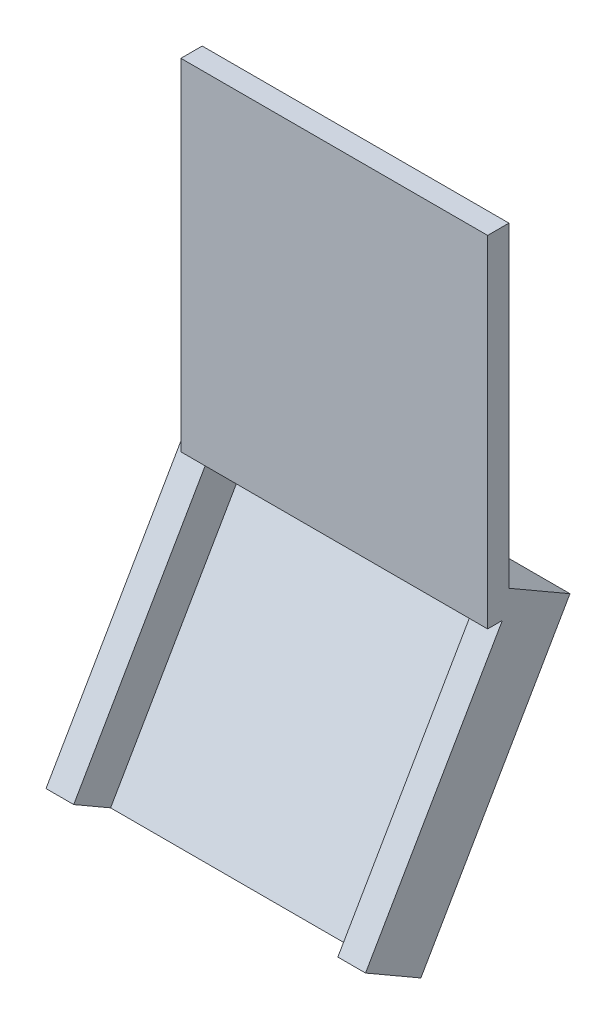
ISO-10303-21;
HEADER;
FILE_DESCRIPTION(('STEP AP214'),'2;1');
FILE_NAME('part.step','',(''),(''),'','','');
FILE_SCHEMA(('AUTOMOTIVE_DESIGN { 1 0 10303 214 1 1 1 1 }'));
ENDSEC;
DATA;
#1=APPLICATION_CONTEXT('core data for automotive mechanical design processes');
#2=APPLICATION_PROTOCOL_DEFINITION('international standard','automotive_design',2000,#1);
#3=PRODUCT_CONTEXT('',#1,'mechanical');
#4=PRODUCT('Part','Part','',(#3));
#5=PRODUCT_RELATED_PRODUCT_CATEGORY('part','',(#4));
#6=PRODUCT_DEFINITION_FORMATION('','',#4);
#7=PRODUCT_DEFINITION_CONTEXT('part definition',#1,'design');
#8=PRODUCT_DEFINITION('design','',#6,#7);
#9=PRODUCT_DEFINITION_SHAPE('','',#8);
#10=(LENGTH_UNIT() NAMED_UNIT(*) SI_UNIT(.MILLI.,.METRE.));
#11=(NAMED_UNIT(*) PLANE_ANGLE_UNIT() SI_UNIT($,.RADIAN.));
#12=(NAMED_UNIT(*) SI_UNIT($,.STERADIAN.) SOLID_ANGLE_UNIT());
#13=UNCERTAINTY_MEASURE_WITH_UNIT(LENGTH_MEASURE(1.E-05),#10,'distance_accuracy_value','');
#14=(GEOMETRIC_REPRESENTATION_CONTEXT(3) GLOBAL_UNCERTAINTY_ASSIGNED_CONTEXT((#13)) GLOBAL_UNIT_ASSIGNED_CONTEXT((#10,
#11,#12)) REPRESENTATION_CONTEXT('',''));
#15=CARTESIAN_POINT('',(0.,0.,0.));
#16=DIRECTION('',(0.,0.,1.));
#17=DIRECTION('',(1.,0.,0.));
#18=AXIS2_PLACEMENT_3D('',#15,#16,#17);
#19=CARTESIAN_POINT('',(0.,0.,1.));
#20=DIRECTION('',(0.,1.,0.));
#21=DIRECTION('',(0.,0.,1.));
#22=AXIS2_PLACEMENT_3D('',#19,#20,#21);
#23=PLANE('',#22);
#24=DIRECTION('',(0.,0.,1.));
#25=VECTOR('',#24,1.);
#26=CARTESIAN_POINT('',(0.7,0.,1.));
#27=LINE('',#26,#25);
#28=CARTESIAN_POINT('',(0.7,0.,0.));
#29=VERTEX_POINT('',#28);
#30=CARTESIAN_POINT('',(0.700000000000002,0.,0.309401076758493));
#31=VERTEX_POINT('',#30);
#32=EDGE_CURVE('E191',#29,#31,#27,.T.);
#33=ORIENTED_EDGE('',*,*,#32,.F.);
#34=DIRECTION('',(1.,0.,0.));
#35=VECTOR('',#34,1.);
#36=CARTESIAN_POINT('',(0.,0.,0.));
#37=LINE('',#36,#35);
#38=CARTESIAN_POINT('',(13.1,0.,0.));
#39=VERTEX_POINT('',#38);
#40=EDGE_CURVE('E253',#29,#39,#37,.T.);
#41=ORIENTED_EDGE('',*,*,#40,.T.);
#42=DIRECTION('',(0.,0.,-1.));
#43=VECTOR('',#42,1.);
#44=CARTESIAN_POINT('',(13.1,0.,0.999999999999999));
#45=LINE('',#44,#43);
#46=CARTESIAN_POINT('',(13.1,0.,0.309401076758494));
#47=VERTEX_POINT('',#46);
#48=EDGE_CURVE('E208',#47,#39,#45,.T.);
#49=ORIENTED_EDGE('',*,*,#48,.F.);
#50=DIRECTION('',(-1.,0.,0.));
#51=VECTOR('',#50,1.);
#52=CARTESIAN_POINT('',(0.,0.,0.309401076758493));
#53=LINE('',#52,#51);
#54=CARTESIAN_POINT('',(14.4,0.,0.309401076758494));
#55=VERTEX_POINT('',#54);
#56=EDGE_CURVE('E211',#55,#47,#53,.T.);
#57=ORIENTED_EDGE('',*,*,#56,.F.);
#58=DIRECTION('',(0.,0.,-1.));
#59=VECTOR('',#58,1.);
#60=CARTESIAN_POINT('',(14.4,0.,1.));
#61=LINE('',#60,#59);
#62=CARTESIAN_POINT('',(14.4,0.,1.));
#63=VERTEX_POINT('',#62);
#64=EDGE_CURVE('E263',#63,#55,#61,.T.);
#65=ORIENTED_EDGE('',*,*,#64,.F.);
#66=DIRECTION('',(1.,0.,0.));
#67=VECTOR('',#66,1.);
#68=CARTESIAN_POINT('',(0.,0.,1.));
#69=LINE('',#68,#67);
#70=CARTESIAN_POINT('',(0.,0.,1.));
#71=VERTEX_POINT('',#70);
#72=EDGE_CURVE('E242',#71,#63,#69,.T.);
#73=ORIENTED_EDGE('',*,*,#72,.F.);
#74=DIRECTION('',(0.,0.,-1.));
#75=VECTOR('',#74,1.);
#76=CARTESIAN_POINT('',(0.,0.,1.));
#77=LINE('',#76,#75);
#78=CARTESIAN_POINT('',(0.,0.,0.309401076758493));
#79=VERTEX_POINT('',#78);
#80=EDGE_CURVE('E266',#71,#79,#77,.T.);
#81=ORIENTED_EDGE('',*,*,#80,.T.);
#82=DIRECTION('',(1.,0.,0.));
#83=VECTOR('',#82,1.);
#84=CARTESIAN_POINT('',(0.,0.,0.309401076758493));
#85=LINE('',#84,#83);
#86=EDGE_CURVE('E52',#79,#31,#85,.T.);
#87=ORIENTED_EDGE('',*,*,#86,.T.);
#88=EDGE_LOOP('',(#33,#41,#49,#57,#65,#73,#81,#87));
#89=FACE_BOUND('',#88,.T.);
#90=ADVANCED_FACE('F37',(#89),#23,.F.);
#91=CARTESIAN_POINT('',(-0.6,-0.866025403784432,-1.50000000000001));
#92=DIRECTION('',(0.,0.499999999999995,0.866025403784442));
#93=DIRECTION('',(0.,-0.866025403784442,0.499999999999995));
#94=AXIS2_PLACEMENT_3D('',#91,#92,#93);
#95=PLANE('',#94);
#96=DIRECTION('',(1.,0.,0.));
#97=VECTOR('',#96,1.);
#98=CARTESIAN_POINT('',(-0.6,-0.866025403784432,-1.50000000000001));
#99=LINE('',#98,#97);
#100=CARTESIAN_POINT('',(0.700000000000002,-0.866025403784432,-1.50000000000001));
#101=VERTEX_POINT('',#100);
#102=CARTESIAN_POINT('',(13.1,-0.866025403784433,-1.50000000000001));
#103=VERTEX_POINT('',#102);
#104=EDGE_CURVE('E228',#101,#103,#99,.T.);
#105=ORIENTED_EDGE('',*,*,#104,.F.);
#106=DIRECTION('',(0.,0.866025403784442,-0.499999999999995));
#107=VECTOR('',#106,1.);
#108=CARTESIAN_POINT('',(0.7,-0.866025403784433,-1.50000000000001));
#109=LINE('',#108,#107);
#110=CARTESIAN_POINT('',(0.700000000000002,-12.1243556529822,4.99999999999992));
#111=VERTEX_POINT('',#110);
#112=EDGE_CURVE('E177',#111,#101,#109,.T.);
#113=ORIENTED_EDGE('',*,*,#112,.F.);
#114=DIRECTION('',(1.,0.,0.));
#115=VECTOR('',#114,1.);
#116=CARTESIAN_POINT('',(-0.6,-12.1243556529822,4.99999999999992));
#117=LINE('',#116,#115);
#118=CARTESIAN_POINT('',(13.1,-12.1243556529822,4.99999999999992));
#119=VERTEX_POINT('',#118);
#120=EDGE_CURVE('E225',#111,#119,#117,.T.);
#121=ORIENTED_EDGE('',*,*,#120,.T.);
#122=DIRECTION('',(0.,-0.866025403784442,0.499999999999995));
#123=VECTOR('',#122,1.);
#124=CARTESIAN_POINT('',(13.1,-0.866025403784433,-1.50000000000001));
#125=LINE('',#124,#123);
#126=EDGE_CURVE('E194',#103,#119,#125,.T.);
#127=ORIENTED_EDGE('',*,*,#126,.F.);
#128=EDGE_LOOP('',(#105,#113,#121,#127));
#129=FACE_BOUND('',#128,.T.);
#130=ADVANCED_FACE('F279',(#129),#95,.T.);
#131=CARTESIAN_POINT('',(-0.6,0.,0.));
#132=DIRECTION('',(0.,0.866025403784442,-0.499999999999994));
#133=DIRECTION('',(0.,0.499999999999994,0.866025403784442));
#134=AXIS2_PLACEMENT_3D('',#131,#132,#133);
#135=PLANE('',#134);
#136=DIRECTION('',(0.,-0.499999999999995,-0.866025403784442));
#137=VECTOR('',#136,1.);
#138=CARTESIAN_POINT('',(0.7,0.133974596215557,0.232050807568872));
#139=LINE('',#138,#137);
#140=EDGE_CURVE('E60',#29,#101,#139,.T.);
#141=ORIENTED_EDGE('',*,*,#140,.T.);
#142=ORIENTED_EDGE('',*,*,#104,.T.);
#143=DIRECTION('',(0.,-0.499999999999994,-0.866025403784442));
#144=VECTOR('',#143,1.);
#145=CARTESIAN_POINT('',(13.1,0.,0.));
#146=LINE('',#145,#144);
#147=EDGE_CURVE('E45',#39,#103,#146,.T.);
#148=ORIENTED_EDGE('',*,*,#147,.F.);
#149=ORIENTED_EDGE('',*,*,#40,.F.);
#150=EDGE_LOOP('',(#141,#142,#148,#149));
#151=FACE_BOUND('',#150,.T.);
#152=ADVANCED_FACE('F277',(#151),#135,.F.);
#153=CARTESIAN_POINT('',(0.,0.,1.));
#154=DIRECTION('',(1.,0.,0.));
#155=DIRECTION('',(0.,0.,-1.));
#156=AXIS2_PLACEMENT_3D('',#153,#154,#155);
#157=PLANE('',#156);
#158=DIRECTION('',(0.,-0.499999999999995,-0.866025403784442));
#159=VECTOR('',#158,1.);
#160=CARTESIAN_POINT('',(0.,0.433012701892217,0.750000000000005));
#161=LINE('',#160,#159);
#162=CARTESIAN_POINT('',(0.,0.133974596215557,0.232050807568871));
#163=VERTEX_POINT('',#162);
#164=CARTESIAN_POINT('',(0.,0.,0.));
#165=VERTEX_POINT('',#164);
#166=EDGE_CURVE('E188',#163,#165,#161,.T.);
#167=ORIENTED_EDGE('',*,*,#166,.F.);
#168=DIRECTION('',(0.,-0.866025403784442,0.499999999999995));
#169=VECTOR('',#168,1.);
#170=CARTESIAN_POINT('',(0.,-0.29903810567666,0.482050807568867));
#171=LINE('',#170,#169);
#172=EDGE_CURVE('E11',#163,#79,#171,.T.);
#173=ORIENTED_EDGE('',*,*,#172,.T.);
#174=ORIENTED_EDGE('',*,*,#80,.F.);
#175=DIRECTION('',(0.,-1.,0.));
#176=VECTOR('',#175,1.);
#177=CARTESIAN_POINT('',(0.,0.,1.));
#178=LINE('',#177,#176);
#179=CARTESIAN_POINT('',(0.,16.,1.));
#180=VERTEX_POINT('',#179);
#181=EDGE_CURVE('E239',#180,#71,#178,.T.);
#182=ORIENTED_EDGE('',*,*,#181,.F.);
#183=DIRECTION('',(0.,0.,-1.));
#184=VECTOR('',#183,1.);
#185=CARTESIAN_POINT('',(0.,16.,1.));
#186=LINE('',#185,#184);
#187=CARTESIAN_POINT('',(0.,16.,0.));
#188=VERTEX_POINT('',#187);
#189=EDGE_CURVE('E249',#180,#188,#186,.T.);
#190=ORIENTED_EDGE('',*,*,#189,.T.);
#191=DIRECTION('',(0.,-1.,0.));
#192=VECTOR('',#191,1.);
#193=CARTESIAN_POINT('',(0.,0.,0.));
#194=LINE('',#193,#192);
#195=CARTESIAN_POINT('',(0.,1.15470053837923,0.));
#196=VERTEX_POINT('',#195);
#197=EDGE_CURVE('E250',#188,#196,#194,.T.);
#198=ORIENTED_EDGE('',*,*,#197,.T.);
#199=EDGE_CURVE('E227',#196,#165,#194,.T.);
#200=ORIENTED_EDGE('',*,*,#199,.T.);
#201=EDGE_LOOP('',(#167,#173,#174,#182,#190,#198,#200));
#202=FACE_BOUND('',#201,.T.);
#203=ADVANCED_FACE('F39',(#202),#157,.F.);
#204=CARTESIAN_POINT('',(0.,0.,0.));
#205=DIRECTION('',(0.,0.,-1.));
#206=DIRECTION('',(-1.,0.,0.));
#207=AXIS2_PLACEMENT_3D('',#204,#205,#206);
#208=PLANE('',#207);
#209=DIRECTION('',(0.,1.,0.));
#210=VECTOR('',#209,1.);
#211=CARTESIAN_POINT('',(14.4,0.,0.));
#212=LINE('',#211,#210);
#213=CARTESIAN_POINT('',(14.4,1.15470053837923,0.));
#214=VERTEX_POINT('',#213);
#215=CARTESIAN_POINT('',(14.4,16.,0.));
#216=VERTEX_POINT('',#215);
#217=EDGE_CURVE('E255',#214,#216,#212,.T.);
#218=ORIENTED_EDGE('',*,*,#217,.F.);
#219=DIRECTION('',(-1.,0.,0.));
#220=VECTOR('',#219,1.);
#221=CARTESIAN_POINT('',(0.,1.15470053837924,0.));
#222=LINE('',#221,#220);
#223=EDGE_CURVE('E268',#214,#196,#222,.T.);
#224=ORIENTED_EDGE('',*,*,#223,.T.);
#225=ORIENTED_EDGE('',*,*,#197,.F.);
#226=DIRECTION('',(-1.,0.,0.));
#227=VECTOR('',#226,1.);
#228=CARTESIAN_POINT('',(0.,16.,0.));
#229=LINE('',#228,#227);
#230=EDGE_CURVE('E243',#216,#188,#229,.T.);
#231=ORIENTED_EDGE('',*,*,#230,.F.);
#232=EDGE_LOOP('',(#218,#224,#225,#231));
#233=FACE_BOUND('',#232,.T.);
#234=ADVANCED_FACE('F315',(#233),#208,.T.);
#235=CARTESIAN_POINT('',(14.4,0.,1.));
#236=DIRECTION('',(-1.,0.,0.));
#237=DIRECTION('',(0.,0.,1.));
#238=AXIS2_PLACEMENT_3D('',#235,#236,#237);
#239=PLANE('',#238);
#240=ORIENTED_EDGE('',*,*,#64,.T.);
#241=DIRECTION('',(0.,0.866025403784442,-0.499999999999995));
#242=VECTOR('',#241,1.);
#243=CARTESIAN_POINT('',(14.4,0.133974596215557,0.232050807568872));
#244=LINE('',#243,#242);
#245=CARTESIAN_POINT('',(14.4,-11.1243556529822,6.73205080756881));
#246=VERTEX_POINT('',#245);
#247=EDGE_CURVE('E195',#246,#55,#244,.T.);
#248=ORIENTED_EDGE('',*,*,#247,.F.);
#249=DIRECTION('',(0.,0.499999999999995,0.866025403784442));
#250=VECTOR('',#249,1.);
#251=CARTESIAN_POINT('',(14.4,-11.2583302491977,6.49999999999994));
#252=LINE('',#251,#250);
#253=CARTESIAN_POINT('',(14.4,-12.6243556529822,4.13397459621548));
#254=VERTEX_POINT('',#253);
#255=EDGE_CURVE('E213',#254,#246,#252,.T.);
#256=ORIENTED_EDGE('',*,*,#255,.F.);
#257=DIRECTION('',(0.,-0.866025403784442,0.499999999999995));
#258=VECTOR('',#257,1.);
#259=CARTESIAN_POINT('',(14.4,-1.36602540378443,-2.36602540378445));
#260=LINE('',#259,#258);
#261=CARTESIAN_POINT('',(14.4,-0.499999999999995,-2.86602540378444));
#262=VERTEX_POINT('',#261);
#263=EDGE_CURVE('E222',#262,#254,#260,.T.);
#264=ORIENTED_EDGE('',*,*,#263,.F.);
#265=DIRECTION('',(0.,-0.499999999999995,-0.866025403784442));
#266=VECTOR('',#265,1.);
#267=CARTESIAN_POINT('',(14.4,0.866025403784432,-0.499999999999989));
#268=LINE('',#267,#266);
#269=EDGE_CURVE('E159',#214,#262,#268,.T.);
#270=ORIENTED_EDGE('',*,*,#269,.F.);
#271=ORIENTED_EDGE('',*,*,#217,.T.);
#272=DIRECTION('',(0.,0.,-1.));
#273=VECTOR('',#272,1.);
#274=CARTESIAN_POINT('',(14.4,16.,1.));
#275=LINE('',#274,#273);
#276=CARTESIAN_POINT('',(14.4,16.,1.));
#277=VERTEX_POINT('',#276);
#278=EDGE_CURVE('E260',#277,#216,#275,.T.);
#279=ORIENTED_EDGE('',*,*,#278,.F.);
#280=DIRECTION('',(0.,1.,0.));
#281=VECTOR('',#280,1.);
#282=CARTESIAN_POINT('',(14.4,0.,1.));
#283=LINE('',#282,#281);
#284=EDGE_CURVE('E245',#63,#277,#283,.T.);
#285=ORIENTED_EDGE('',*,*,#284,.F.);
#286=EDGE_LOOP('',(#240,#248,#256,#264,#270,#271,#279,#285));
#287=FACE_BOUND('',#286,.T.);
#288=ADVANCED_FACE('F303',(#287),#239,.F.);
#289=CARTESIAN_POINT('',(0.,16.,1.));
#290=DIRECTION('',(0.,-1.,0.));
#291=DIRECTION('',(0.,0.,-1.));
#292=AXIS2_PLACEMENT_3D('',#289,#290,#291);
#293=PLANE('',#292);
#294=ORIENTED_EDGE('',*,*,#230,.T.);
#295=ORIENTED_EDGE('',*,*,#189,.F.);
#296=DIRECTION('',(-1.,0.,0.));
#297=VECTOR('',#296,1.);
#298=CARTESIAN_POINT('',(0.,16.,1.));
#299=LINE('',#298,#297);
#300=EDGE_CURVE('E247',#277,#180,#299,.T.);
#301=ORIENTED_EDGE('',*,*,#300,.F.);
#302=ORIENTED_EDGE('',*,*,#278,.T.);
#303=EDGE_LOOP('',(#294,#295,#301,#302));
#304=FACE_BOUND('',#303,.T.);
#305=ADVANCED_FACE('F331',(#304),#293,.F.);
#306=CARTESIAN_POINT('',(0.,0.,1.));
#307=DIRECTION('',(0.,0.,-1.));
#308=DIRECTION('',(-1.,0.,0.));
#309=AXIS2_PLACEMENT_3D('',#306,#307,#308);
#310=PLANE('',#309);
#311=ORIENTED_EDGE('',*,*,#181,.T.);
#312=ORIENTED_EDGE('',*,*,#72,.T.);
#313=ORIENTED_EDGE('',*,*,#284,.T.);
#314=ORIENTED_EDGE('',*,*,#300,.T.);
#315=EDGE_LOOP('',(#311,#312,#313,#314));
#316=FACE_BOUND('',#315,.T.);
#317=ADVANCED_FACE('F311',(#316),#310,.F.);
#318=CARTESIAN_POINT('',(-0.6,0.,0.));
#319=DIRECTION('',(0.,0.,-1.));
#320=DIRECTION('',(-1.,0.,0.));
#321=AXIS2_PLACEMENT_3D('',#318,#319,#320);
#322=PLANE('',#321);
#323=DIRECTION('',(1.,0.,0.));
#324=VECTOR('',#323,1.);
#325=CARTESIAN_POINT('',(-0.6,0.,0.));
#326=LINE('',#325,#324);
#327=CARTESIAN_POINT('',(-0.6,0.,0.));
#328=VERTEX_POINT('',#327);
#329=EDGE_CURVE('E230',#328,#165,#326,.T.);
#330=ORIENTED_EDGE('',*,*,#329,.T.);
#331=ORIENTED_EDGE('',*,*,#199,.F.);
#332=DIRECTION('',(1.,0.,0.));
#333=VECTOR('',#332,1.);
#334=CARTESIAN_POINT('',(-0.6,1.15470053837923,0.));
#335=LINE('',#334,#333);
#336=CARTESIAN_POINT('',(-0.6,1.15470053837923,0.));
#337=VERTEX_POINT('',#336);
#338=EDGE_CURVE('E232',#337,#196,#335,.T.);
#339=ORIENTED_EDGE('',*,*,#338,.F.);
#340=DIRECTION('',(0.,1.,0.));
#341=VECTOR('',#340,1.);
#342=CARTESIAN_POINT('',(-0.6,0.,0.));
#343=LINE('',#342,#341);
#344=EDGE_CURVE('E218',#328,#337,#343,.T.);
#345=ORIENTED_EDGE('',*,*,#344,.F.);
#346=EDGE_LOOP('',(#330,#331,#339,#345));
#347=FACE_BOUND('',#346,.T.);
#348=ADVANCED_FACE('F292',(#347),#322,.F.);
#349=CARTESIAN_POINT('',(-0.6,-11.2583302491977,6.49999999999994));
#350=DIRECTION('',(0.,0.866025403784442,-0.499999999999995));
#351=DIRECTION('',(0.,0.499999999999995,0.866025403784442));
#352=AXIS2_PLACEMENT_3D('',#349,#350,#351);
#353=PLANE('',#352);
#354=ORIENTED_EDGE('',*,*,#255,.T.);
#355=DIRECTION('',(1.,0.,0.));
#356=VECTOR('',#355,1.);
#357=CARTESIAN_POINT('',(14.4,-11.1243556529822,6.73205080756881));
#358=LINE('',#357,#356);
#359=CARTESIAN_POINT('',(13.1,-11.1243556529822,6.73205080756881));
#360=VERTEX_POINT('',#359);
#361=EDGE_CURVE('E200',#360,#246,#358,.T.);
#362=ORIENTED_EDGE('',*,*,#361,.F.);
#363=DIRECTION('',(0.,-0.499999999999995,-0.866025403784442));
#364=VECTOR('',#363,1.);
#365=CARTESIAN_POINT('',(13.1,-11.1243556529822,6.73205080756881));
#366=LINE('',#365,#364);
#367=EDGE_CURVE('E203',#360,#119,#366,.T.);
#368=ORIENTED_EDGE('',*,*,#367,.T.);
#369=ORIENTED_EDGE('',*,*,#120,.F.);
#370=DIRECTION('',(0.,-0.499999999999995,-0.866025403784442));
#371=VECTOR('',#370,1.);
#372=CARTESIAN_POINT('',(0.700000000000002,-11.1243556529822,6.73205080756881));
#373=LINE('',#372,#371);
#374=CARTESIAN_POINT('',(0.700000000000002,-11.1243556529822,6.73205080756881));
#375=VERTEX_POINT('',#374);
#376=EDGE_CURVE('E166',#375,#111,#373,.T.);
#377=ORIENTED_EDGE('',*,*,#376,.F.);
#378=DIRECTION('',(1.,0.,0.));
#379=VECTOR('',#378,1.);
#380=CARTESIAN_POINT('',(-0.6,-11.1243556529822,6.73205080756881));
#381=LINE('',#380,#379);
#382=CARTESIAN_POINT('',(-0.6,-11.1243556529822,6.73205080756881));
#383=VERTEX_POINT('',#382);
#384=EDGE_CURVE('E162',#383,#375,#381,.T.);
#385=ORIENTED_EDGE('',*,*,#384,.F.);
#386=DIRECTION('',(0.,0.499999999999995,0.866025403784442));
#387=VECTOR('',#386,1.);
#388=CARTESIAN_POINT('',(-0.6,-11.2583302491977,6.49999999999994));
#389=LINE('',#388,#387);
#390=CARTESIAN_POINT('',(-0.6,-12.6243556529822,4.13397459621548));
#391=VERTEX_POINT('',#390);
#392=EDGE_CURVE('E148',#391,#383,#389,.T.);
#393=ORIENTED_EDGE('',*,*,#392,.F.);
#394=DIRECTION('',(1.,0.,0.));
#395=VECTOR('',#394,1.);
#396=CARTESIAN_POINT('',(-0.6,-12.6243556529822,4.13397459621548));
#397=LINE('',#396,#395);
#398=EDGE_CURVE('E220',#391,#254,#397,.T.);
#399=ORIENTED_EDGE('',*,*,#398,.T.);
#400=EDGE_LOOP('',(#354,#362,#368,#369,#377,#385,#393,#399));
#401=FACE_BOUND('',#400,.T.);
#402=ADVANCED_FACE('F163',(#401),#353,.F.);
#403=CARTESIAN_POINT('',(-0.6,0.866025403784432,-0.499999999999989));
#404=DIRECTION('',(0.,-0.866025403784442,0.499999999999995));
#405=DIRECTION('',(0.,-0.499999999999995,-0.866025403784442));
#406=AXIS2_PLACEMENT_3D('',#403,#404,#405);
#407=PLANE('',#406);
#408=ORIENTED_EDGE('',*,*,#269,.T.);
#409=DIRECTION('',(1.,0.,0.));
#410=VECTOR('',#409,1.);
#411=CARTESIAN_POINT('',(-0.6,-0.499999999999995,-2.86602540378444));
#412=LINE('',#411,#410);
#413=CARTESIAN_POINT('',(-0.6,-0.499999999999995,-2.86602540378444));
#414=VERTEX_POINT('',#413);
#415=EDGE_CURVE('E235',#414,#262,#412,.T.);
#416=ORIENTED_EDGE('',*,*,#415,.F.);
#417=DIRECTION('',(0.,-0.499999999999995,-0.866025403784442));
#418=VECTOR('',#417,1.);
#419=CARTESIAN_POINT('',(-0.6,0.866025403784432,-0.499999999999989));
#420=LINE('',#419,#418);
#421=EDGE_CURVE('E216',#337,#414,#420,.T.);
#422=ORIENTED_EDGE('',*,*,#421,.F.);
#423=ORIENTED_EDGE('',*,*,#338,.T.);
#424=ORIENTED_EDGE('',*,*,#223,.F.);
#425=EDGE_LOOP('',(#408,#416,#422,#423,#424));
#426=FACE_BOUND('',#425,.T.);
#427=ADVANCED_FACE('F296',(#426),#407,.F.);
#428=CARTESIAN_POINT('',(-0.6,-1.36602540378443,-2.36602540378445));
#429=DIRECTION('',(0.,0.499999999999995,0.866025403784442));
#430=DIRECTION('',(0.,-0.866025403784442,0.499999999999995));
#431=AXIS2_PLACEMENT_3D('',#428,#429,#430);
#432=PLANE('',#431);
#433=ORIENTED_EDGE('',*,*,#263,.T.);
#434=ORIENTED_EDGE('',*,*,#398,.F.);
#435=DIRECTION('',(0.,-0.866025403784442,0.499999999999995));
#436=VECTOR('',#435,1.);
#437=CARTESIAN_POINT('',(-0.6,-1.36602540378443,-2.36602540378445));
#438=LINE('',#437,#436);
#439=EDGE_CURVE('E155',#414,#391,#438,.T.);
#440=ORIENTED_EDGE('',*,*,#439,.F.);
#441=ORIENTED_EDGE('',*,*,#415,.T.);
#442=EDGE_LOOP('',(#433,#434,#440,#441));
#443=FACE_BOUND('',#442,.T.);
#444=ADVANCED_FACE('F299',(#443),#432,.F.);
#445=CARTESIAN_POINT('',(-0.6,0.,0.));
#446=DIRECTION('',(1.,0.,0.));
#447=DIRECTION('',(0.,0.,-1.));
#448=AXIS2_PLACEMENT_3D('',#445,#446,#447);
#449=PLANE('',#448);
#450=DIRECTION('',(0.,-0.499999999999995,-0.866025403784442));
#451=VECTOR('',#450,1.);
#452=CARTESIAN_POINT('',(-0.6,0.133974596215557,0.232050807568872));
#453=LINE('',#452,#451);
#454=CARTESIAN_POINT('',(-0.6,0.133974596215557,0.232050807568872));
#455=VERTEX_POINT('',#454);
#456=EDGE_CURVE('E183',#455,#328,#453,.T.);
#457=ORIENTED_EDGE('',*,*,#456,.T.);
#458=ORIENTED_EDGE('',*,*,#344,.T.);
#459=ORIENTED_EDGE('',*,*,#421,.T.);
#460=ORIENTED_EDGE('',*,*,#439,.T.);
#461=ORIENTED_EDGE('',*,*,#392,.T.);
#462=DIRECTION('',(0.,-0.866025403784442,0.499999999999995));
#463=VECTOR('',#462,1.);
#464=CARTESIAN_POINT('',(-0.6,0.133974596215557,0.232050807568872));
#465=LINE('',#464,#463);
#466=EDGE_CURVE('E153',#455,#383,#465,.T.);
#467=ORIENTED_EDGE('',*,*,#466,.F.);
#468=EDGE_LOOP('',(#457,#458,#459,#460,#461,#467));
#469=FACE_BOUND('',#468,.T.);
#470=ADVANCED_FACE('F151',(#469),#449,.F.);
#471=CARTESIAN_POINT('',(0.,0.133974596215556,0.232050807568871));
#472=DIRECTION('',(0.,-0.499999999999995,-0.866025403784442));
#473=DIRECTION('',(0.,0.866025403784442,-0.499999999999995));
#474=AXIS2_PLACEMENT_3D('',#471,#472,#473);
#475=PLANE('',#474);
#476=ORIENTED_EDGE('',*,*,#247,.T.);
#477=ORIENTED_EDGE('',*,*,#56,.T.);
#478=DIRECTION('',(0.,-0.866025403784442,0.499999999999995));
#479=VECTOR('',#478,1.);
#480=CARTESIAN_POINT('',(13.1,0.133974596215557,0.232050807568872));
#481=LINE('',#480,#479);
#482=EDGE_CURVE('E198',#47,#360,#481,.T.);
#483=ORIENTED_EDGE('',*,*,#482,.T.);
#484=ORIENTED_EDGE('',*,*,#361,.T.);
#485=EDGE_LOOP('',(#476,#477,#483,#484));
#486=FACE_BOUND('',#485,.T.);
#487=ADVANCED_FACE('F307',(#486),#475,.F.);
#488=CARTESIAN_POINT('',(13.1,0.133974596215557,0.232050807568872));
#489=DIRECTION('',(1.,0.,0.));
#490=DIRECTION('',(0.,1.,0.));
#491=AXIS2_PLACEMENT_3D('',#488,#489,#490);
#492=PLANE('',#491);
#493=ORIENTED_EDGE('',*,*,#482,.F.);
#494=ORIENTED_EDGE('',*,*,#48,.T.);
#495=ORIENTED_EDGE('',*,*,#147,.T.);
#496=ORIENTED_EDGE('',*,*,#126,.T.);
#497=ORIENTED_EDGE('',*,*,#367,.F.);
#498=EDGE_LOOP('',(#493,#494,#495,#496,#497));
#499=FACE_BOUND('',#498,.T.);
#500=ADVANCED_FACE('F274',(#499),#492,.F.);
#501=CARTESIAN_POINT('',(0.,0.133974596215556,0.232050807568872));
#502=DIRECTION('',(0.,0.499999999999995,0.866025403784442));
#503=DIRECTION('',(0.,-0.866025403784442,0.499999999999995));
#504=AXIS2_PLACEMENT_3D('',#501,#502,#503);
#505=PLANE('',#504);
#506=ORIENTED_EDGE('',*,*,#86,.F.);
#507=ORIENTED_EDGE('',*,*,#172,.F.);
#508=DIRECTION('',(-1.,0.,0.));
#509=VECTOR('',#508,1.);
#510=CARTESIAN_POINT('',(-0.6,0.133974596215557,0.232050807568872));
#511=LINE('',#510,#509);
#512=EDGE_CURVE('E175',#163,#455,#511,.T.);
#513=ORIENTED_EDGE('',*,*,#512,.T.);
#514=ORIENTED_EDGE('',*,*,#466,.T.);
#515=ORIENTED_EDGE('',*,*,#384,.T.);
#516=DIRECTION('',(0.,0.866025403784442,-0.499999999999995));
#517=VECTOR('',#516,1.);
#518=CARTESIAN_POINT('',(0.7,0.133974596215557,0.232050807568872));
#519=LINE('',#518,#517);
#520=EDGE_CURVE('E170',#375,#31,#519,.T.);
#521=ORIENTED_EDGE('',*,*,#520,.T.);
#522=EDGE_LOOP('',(#506,#507,#513,#514,#515,#521));
#523=FACE_BOUND('',#522,.T.);
#524=ADVANCED_FACE('F172',(#523),#505,.T.);
#525=CARTESIAN_POINT('',(0.7,0.133974596215557,0.232050807568872));
#526=DIRECTION('',(-1.,0.,0.));
#527=DIRECTION('',(0.,-1.,0.));
#528=AXIS2_PLACEMENT_3D('',#525,#526,#527);
#529=PLANE('',#528);
#530=ORIENTED_EDGE('',*,*,#140,.F.);
#531=ORIENTED_EDGE('',*,*,#32,.T.);
#532=ORIENTED_EDGE('',*,*,#520,.F.);
#533=ORIENTED_EDGE('',*,*,#376,.T.);
#534=ORIENTED_EDGE('',*,*,#112,.T.);
#535=EDGE_LOOP('',(#530,#531,#532,#533,#534));
#536=FACE_BOUND('',#535,.T.);
#537=ADVANCED_FACE('F282',(#536),#529,.F.);
#538=CARTESIAN_POINT('',(-0.6,0.133974596215557,0.232050807568872));
#539=DIRECTION('',(0.,-0.866025403784442,0.499999999999995));
#540=DIRECTION('',(0.,-0.499999999999995,-0.866025403784442));
#541=AXIS2_PLACEMENT_3D('',#538,#539,#540);
#542=PLANE('',#541);
#543=ORIENTED_EDGE('',*,*,#512,.F.);
#544=ORIENTED_EDGE('',*,*,#166,.T.);
#545=ORIENTED_EDGE('',*,*,#329,.F.);
#546=ORIENTED_EDGE('',*,*,#456,.F.);
#547=EDGE_LOOP('',(#543,#544,#545,#546));
#548=FACE_BOUND('',#547,.T.);
#549=ADVANCED_FACE('F286',(#548),#542,.F.);
#550=CLOSED_SHELL('',(#90,#130,#152,#203,#234,#288,#305,#317,#348,#402,#427,#444,#470,#487,#500,
#524,#537,#549));
#551=MANIFOLD_SOLID_BREP('B2',#550);
#552=ADVANCED_BREP_SHAPE_REPRESENTATION('',(#18,#551),#14);
#553=SHAPE_DEFINITION_REPRESENTATION(#9,#552);
ENDSEC;
END-ISO-10303-21;
